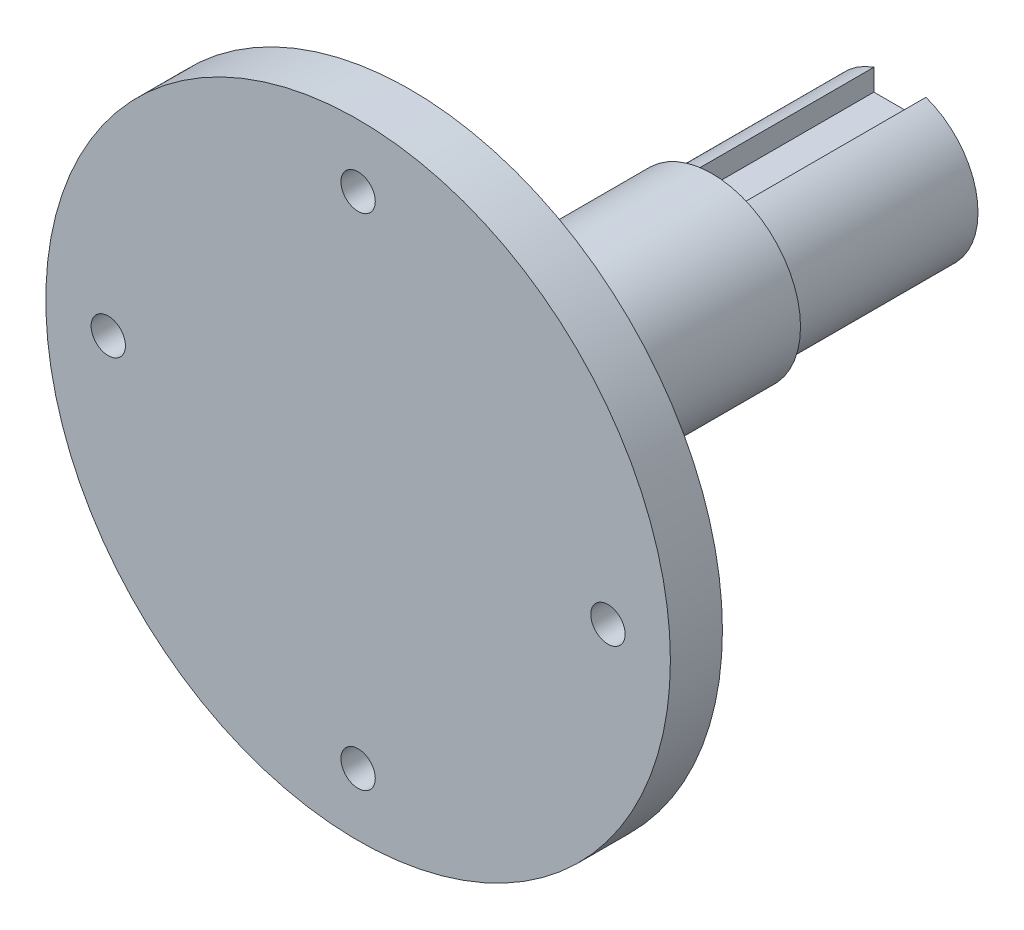
ISO-10303-21;
HEADER;
FILE_DESCRIPTION(('STEP AP214'),'2;1');
FILE_NAME('part.step','',(''),(''),'','','');
FILE_SCHEMA(('AUTOMOTIVE_DESIGN { 1 0 10303 214 1 1 1 1 }'));
ENDSEC;
DATA;
#1=APPLICATION_CONTEXT('core data for automotive mechanical design processes');
#2=APPLICATION_PROTOCOL_DEFINITION('international standard','automotive_design',2000,#1);
#3=PRODUCT_CONTEXT('',#1,'mechanical');
#4=PRODUCT('Part','Part','',(#3));
#5=PRODUCT_RELATED_PRODUCT_CATEGORY('part','',(#4));
#6=PRODUCT_DEFINITION_FORMATION('','',#4);
#7=PRODUCT_DEFINITION_CONTEXT('part definition',#1,'design');
#8=PRODUCT_DEFINITION('design','',#6,#7);
#9=PRODUCT_DEFINITION_SHAPE('','',#8);
#10=(LENGTH_UNIT() NAMED_UNIT(*) SI_UNIT(.MILLI.,.METRE.));
#11=(NAMED_UNIT(*) PLANE_ANGLE_UNIT() SI_UNIT($,.RADIAN.));
#12=(NAMED_UNIT(*) SI_UNIT($,.STERADIAN.) SOLID_ANGLE_UNIT());
#13=UNCERTAINTY_MEASURE_WITH_UNIT(LENGTH_MEASURE(1.E-05),#10,'distance_accuracy_value','');
#14=(GEOMETRIC_REPRESENTATION_CONTEXT(3) GLOBAL_UNCERTAINTY_ASSIGNED_CONTEXT((#13)) GLOBAL_UNIT_ASSIGNED_CONTEXT((#10,
#11,#12)) REPRESENTATION_CONTEXT('',''));
#15=CARTESIAN_POINT('',(0.,0.,0.));
#16=DIRECTION('',(0.,0.,1.));
#17=DIRECTION('',(1.,0.,0.));
#18=AXIS2_PLACEMENT_3D('',#15,#16,#17);
#19=CARTESIAN_POINT('',(0.,0.,20.05));
#20=DIRECTION('',(0.,0.,-1.));
#21=DIRECTION('',(-1.,0.,0.));
#22=AXIS2_PLACEMENT_3D('',#19,#20,#21);
#23=CYLINDRICAL_SURFACE('',#22,7.5);
#24=CARTESIAN_POINT('',(0.,0.,2.));
#25=DIRECTION('',(0.,0.,-1.));
#26=DIRECTION('',(-1.,0.,0.));
#27=AXIS2_PLACEMENT_3D('',#24,#25,#26);
#28=CIRCLE('',#27,7.5);
#29=CARTESIAN_POINT('',(2.5,7.07106781186548,2.));
#30=VERTEX_POINT('',#29);
#31=CARTESIAN_POINT('',(-2.5,7.07106781186548,2.));
#32=VERTEX_POINT('',#31);
#33=EDGE_CURVE('E90',#30,#32,#28,.T.);
#34=ORIENTED_EDGE('',*,*,#33,.F.);
#35=DIRECTION('',(0.,0.,-1.));
#36=VECTOR('',#35,1.);
#37=CARTESIAN_POINT('',(2.5,7.07106781186547,20.05));
#38=LINE('',#37,#36);
#39=CARTESIAN_POINT('',(2.5,7.07106781186548,20.05));
#40=VERTEX_POINT('',#39);
#41=EDGE_CURVE('E170',#30,#40,#38,.F.);
#42=ORIENTED_EDGE('',*,*,#41,.T.);
#43=CARTESIAN_POINT('',(0.,0.,20.05));
#44=DIRECTION('',(0.,0.,1.));
#45=DIRECTION('',(1.,0.,0.));
#46=AXIS2_PLACEMENT_3D('',#43,#44,#45);
#47=CIRCLE('',#46,7.5);
#48=CARTESIAN_POINT('',(-2.5,7.07106781186548,20.05));
#49=VERTEX_POINT('',#48);
#50=EDGE_CURVE('E111',#49,#40,#47,.T.);
#51=ORIENTED_EDGE('',*,*,#50,.F.);
#52=DIRECTION('',(0.,0.,-1.));
#53=VECTOR('',#52,1.);
#54=CARTESIAN_POINT('',(-2.5,7.07106781186548,20.05));
#55=LINE('',#54,#53);
#56=EDGE_CURVE('E104',#49,#32,#55,.T.);
#57=ORIENTED_EDGE('',*,*,#56,.T.);
#58=EDGE_LOOP('',(#34,#42,#51,#57));
#59=FACE_BOUND('',#58,.T.);
#60=ADVANCED_FACE('F45',(#59),#23,.T.);
#61=CARTESIAN_POINT('',(-2.5,5.,21.));
#62=DIRECTION('',(-1.,0.,0.));
#63=DIRECTION('',(0.,0.,1.));
#64=AXIS2_PLACEMENT_3D('',#61,#62,#63);
#65=PLANE('',#64);
#66=DIRECTION('',(0.,-1.,0.));
#67=VECTOR('',#66,1.);
#68=CARTESIAN_POINT('',(-2.5,5.,2.));
#69=LINE('',#68,#67);
#70=CARTESIAN_POINT('',(-2.5,5.,2.00000000000001));
#71=VERTEX_POINT('',#70);
#72=EDGE_CURVE('E62',#32,#71,#69,.T.);
#73=ORIENTED_EDGE('',*,*,#72,.F.);
#74=ORIENTED_EDGE('',*,*,#56,.F.);
#75=DIRECTION('',(0.,-1.,0.));
#76=VECTOR('',#75,1.);
#77=CARTESIAN_POINT('',(-2.5,0.,20.05));
#78=LINE('',#77,#76);
#79=CARTESIAN_POINT('',(-2.5,5.,20.05));
#80=VERTEX_POINT('',#79);
#81=EDGE_CURVE('E113',#49,#80,#78,.T.);
#82=ORIENTED_EDGE('',*,*,#81,.T.);
#83=DIRECTION('',(0.,0.,-1.));
#84=VECTOR('',#83,1.);
#85=CARTESIAN_POINT('',(-2.5,5.,21.));
#86=LINE('',#85,#84);
#87=EDGE_CURVE('E107',#80,#71,#86,.T.);
#88=ORIENTED_EDGE('',*,*,#87,.T.);
#89=EDGE_LOOP('',(#73,#74,#82,#88));
#90=FACE_BOUND('',#89,.T.);
#91=ADVANCED_FACE('F102',(#90),#65,.F.);
#92=CARTESIAN_POINT('',(2.5,5.,21.));
#93=DIRECTION('',(1.,0.,0.));
#94=DIRECTION('',(0.,0.,-1.));
#95=AXIS2_PLACEMENT_3D('',#92,#93,#94);
#96=PLANE('',#95);
#97=DIRECTION('',(0.,1.,0.));
#98=VECTOR('',#97,1.);
#99=CARTESIAN_POINT('',(2.5,5.,2.));
#100=LINE('',#99,#98);
#101=CARTESIAN_POINT('',(2.5,5.,2.));
#102=VERTEX_POINT('',#101);
#103=EDGE_CURVE('E93',#102,#30,#100,.T.);
#104=ORIENTED_EDGE('',*,*,#103,.F.);
#105=DIRECTION('',(0.,0.,-1.));
#106=VECTOR('',#105,1.);
#107=CARTESIAN_POINT('',(2.5,5.,21.));
#108=LINE('',#107,#106);
#109=CARTESIAN_POINT('',(2.5,5.,20.05));
#110=VERTEX_POINT('',#109);
#111=EDGE_CURVE('E156',#110,#102,#108,.T.);
#112=ORIENTED_EDGE('',*,*,#111,.F.);
#113=DIRECTION('',(0.,1.,0.));
#114=VECTOR('',#113,1.);
#115=CARTESIAN_POINT('',(2.5,0.,20.05));
#116=LINE('',#115,#114);
#117=EDGE_CURVE('E70',#110,#40,#116,.T.);
#118=ORIENTED_EDGE('',*,*,#117,.T.);
#119=ORIENTED_EDGE('',*,*,#41,.F.);
#120=EDGE_LOOP('',(#104,#112,#118,#119));
#121=FACE_BOUND('',#120,.T.);
#122=ADVANCED_FACE('F177',(#121),#96,.F.);
#123=CARTESIAN_POINT('',(2.5,5.,21.));
#124=DIRECTION('',(0.,-1.,0.));
#125=DIRECTION('',(0.,0.,-1.));
#126=AXIS2_PLACEMENT_3D('',#123,#124,#125);
#127=PLANE('',#126);
#128=DIRECTION('',(1.,0.,0.));
#129=VECTOR('',#128,1.);
#130=CARTESIAN_POINT('',(2.5,5.,2.));
#131=LINE('',#130,#129);
#132=EDGE_CURVE('E179',#71,#102,#131,.T.);
#133=ORIENTED_EDGE('',*,*,#132,.F.);
#134=ORIENTED_EDGE('',*,*,#87,.F.);
#135=DIRECTION('',(1.,0.,0.));
#136=VECTOR('',#135,1.);
#137=CARTESIAN_POINT('',(0.,5.,20.05));
#138=LINE('',#137,#136);
#139=EDGE_CURVE('E119',#80,#110,#138,.T.);
#140=ORIENTED_EDGE('',*,*,#139,.T.);
#141=ORIENTED_EDGE('',*,*,#111,.T.);
#142=EDGE_LOOP('',(#133,#134,#140,#141));
#143=FACE_BOUND('',#142,.T.);
#144=ADVANCED_FACE('F175',(#143),#127,.F.);
#145=CARTESIAN_POINT('',(0.,0.,44.05));
#146=DIRECTION('',(0.,0.,-1.));
#147=DIRECTION('',(-1.,0.,0.));
#148=AXIS2_PLACEMENT_3D('',#145,#146,#147);
#149=CYLINDRICAL_SURFACE('',#148,8.5);
#150=CARTESIAN_POINT('',(0.,0.,43.45));
#151=DIRECTION('',(0.,0.,1.));
#152=DIRECTION('',(1.,0.,0.));
#153=AXIS2_PLACEMENT_3D('',#150,#151,#152);
#154=CIRCLE('',#153,8.5);
#155=CARTESIAN_POINT('',(8.5,0.,43.45));
#156=VERTEX_POINT('',#155);
#157=EDGE_CURVE('E55',#156,#156,#154,.F.);
#158=ORIENTED_EDGE('',*,*,#157,.T.);
#159=EDGE_LOOP('',(#158));
#160=FACE_BOUND('',#159,.T.);
#161=CARTESIAN_POINT('',(0.,0.,20.05));
#162=DIRECTION('',(0.,0.,1.));
#163=DIRECTION('',(1.,0.,0.));
#164=AXIS2_PLACEMENT_3D('',#161,#162,#163);
#165=CIRCLE('',#164,8.5);
#166=CARTESIAN_POINT('',(8.5,0.,20.05));
#167=VERTEX_POINT('',#166);
#168=EDGE_CURVE('E150',#167,#167,#165,.T.);
#169=ORIENTED_EDGE('',*,*,#168,.T.);
#170=EDGE_LOOP('',(#169));
#171=FACE_BOUND('',#170,.T.);
#172=ADVANCED_FACE('F130',(#160,#171),#149,.T.);
#173=CARTESIAN_POINT('',(0.,0.,20.05));
#174=DIRECTION('',(0.,0.,1.));
#175=DIRECTION('',(1.,0.,0.));
#176=AXIS2_PLACEMENT_3D('',#173,#174,#175);
#177=PLANE('',#176);
#178=ORIENTED_EDGE('',*,*,#81,.F.);
#179=ORIENTED_EDGE('',*,*,#50,.T.);
#180=ORIENTED_EDGE('',*,*,#117,.F.);
#181=ORIENTED_EDGE('',*,*,#139,.F.);
#182=EDGE_LOOP('',(#178,#179,#180,#181));
#183=FACE_BOUND('',#182,.T.);
#184=ORIENTED_EDGE('',*,*,#168,.F.);
#185=EDGE_LOOP('',(#184));
#186=FACE_BOUND('',#185,.T.);
#187=ADVANCED_FACE('F143',(#183,#186),#177,.F.);
#188=CARTESIAN_POINT('',(0.,0.,44.05));
#189=DIRECTION('',(0.,0.,1.));
#190=DIRECTION('',(1.,0.,0.));
#191=AXIS2_PLACEMENT_3D('',#188,#189,#190);
#192=PLANE('',#191);
#193=CARTESIAN_POINT('',(0.,0.,44.05));
#194=DIRECTION('',(0.,0.,1.));
#195=DIRECTION('',(1.,0.,0.));
#196=AXIS2_PLACEMENT_3D('',#193,#194,#195);
#197=CIRCLE('',#196,9.1);
#198=CARTESIAN_POINT('',(9.1,0.,44.05));
#199=VERTEX_POINT('',#198);
#200=EDGE_CURVE('E117',#199,#199,#197,.T.);
#201=ORIENTED_EDGE('',*,*,#200,.T.);
#202=EDGE_LOOP('',(#201));
#203=FACE_BOUND('',#202,.T.);
#204=CARTESIAN_POINT('',(0.,0.,44.05));
#205=DIRECTION('',(0.,0.,1.));
#206=DIRECTION('',(1.,0.,0.));
#207=AXIS2_PLACEMENT_3D('',#204,#205,#206);
#208=CIRCLE('',#207,11.25);
#209=CARTESIAN_POINT('',(11.25,0.,44.05));
#210=VERTEX_POINT('',#209);
#211=EDGE_CURVE('E147',#210,#210,#208,.T.);
#212=ORIENTED_EDGE('',*,*,#211,.F.);
#213=EDGE_LOOP('',(#212));
#214=FACE_BOUND('',#213,.T.);
#215=ADVANCED_FACE('F139',(#203,#214),#192,.F.);
#216=CARTESIAN_POINT('',(0.,0.,54.05));
#217=DIRECTION('',(0.,0.,-1.));
#218=DIRECTION('',(-1.,0.,0.));
#219=AXIS2_PLACEMENT_3D('',#216,#217,#218);
#220=CYLINDRICAL_SURFACE('',#219,30.);
#221=CARTESIAN_POINT('',(0.,0.,54.05));
#222=DIRECTION('',(0.,0.,1.));
#223=DIRECTION('',(1.,0.,0.));
#224=AXIS2_PLACEMENT_3D('',#221,#222,#223);
#225=CIRCLE('',#224,30.);
#226=CARTESIAN_POINT('',(30.,0.,54.05));
#227=VERTEX_POINT('',#226);
#228=EDGE_CURVE('E151',#227,#227,#225,.T.);
#229=ORIENTED_EDGE('',*,*,#228,.F.);
#230=EDGE_LOOP('',(#229));
#231=FACE_BOUND('',#230,.T.);
#232=CARTESIAN_POINT('',(0.,0.,49.05));
#233=DIRECTION('',(0.,0.,1.));
#234=DIRECTION('',(1.,0.,0.));
#235=AXIS2_PLACEMENT_3D('',#232,#233,#234);
#236=CIRCLE('',#235,30.);
#237=CARTESIAN_POINT('',(30.,0.,49.05));
#238=VERTEX_POINT('',#237);
#239=EDGE_CURVE('E159',#238,#238,#236,.T.);
#240=ORIENTED_EDGE('',*,*,#239,.T.);
#241=EDGE_LOOP('',(#240));
#242=FACE_BOUND('',#241,.T.);
#243=ADVANCED_FACE('F142',(#231,#242),#220,.T.);
#244=CARTESIAN_POINT('',(0.,0.,54.05));
#245=DIRECTION('',(0.,0.,1.));
#246=DIRECTION('',(1.,0.,0.));
#247=AXIS2_PLACEMENT_3D('',#244,#245,#246);
#248=PLANE('',#247);
#249=CARTESIAN_POINT('',(0.,24.,54.05));
#250=DIRECTION('',(0.,0.,1.));
#251=DIRECTION('',(1.,0.,0.));
#252=AXIS2_PLACEMENT_3D('',#249,#250,#251);
#253=CIRCLE('',#252,1.64999999999999);
#254=CARTESIAN_POINT('',(1.64999999999999,24.,54.05));
#255=VERTEX_POINT('',#254);
#256=EDGE_CURVE('E187',#255,#255,#253,.T.);
#257=ORIENTED_EDGE('',*,*,#256,.F.);
#258=EDGE_LOOP('',(#257));
#259=FACE_BOUND('',#258,.T.);
#260=CARTESIAN_POINT('',(0.,-24.,54.05));
#261=DIRECTION('',(0.,0.,1.));
#262=DIRECTION('',(1.,0.,0.));
#263=AXIS2_PLACEMENT_3D('',#260,#261,#262);
#264=CIRCLE('',#263,1.64999999999999);
#265=CARTESIAN_POINT('',(1.64999999999999,-24.,54.05));
#266=VERTEX_POINT('',#265);
#267=EDGE_CURVE('E195',#266,#266,#264,.T.);
#268=ORIENTED_EDGE('',*,*,#267,.F.);
#269=EDGE_LOOP('',(#268));
#270=FACE_BOUND('',#269,.T.);
#271=CARTESIAN_POINT('',(24.,0.,54.05));
#272=DIRECTION('',(0.,0.,1.));
#273=DIRECTION('',(1.,0.,0.));
#274=AXIS2_PLACEMENT_3D('',#271,#272,#273);
#275=CIRCLE('',#274,1.64999999999999);
#276=CARTESIAN_POINT('',(25.65,0.,54.05));
#277=VERTEX_POINT('',#276);
#278=EDGE_CURVE('E203',#277,#277,#275,.T.);
#279=ORIENTED_EDGE('',*,*,#278,.F.);
#280=EDGE_LOOP('',(#279));
#281=FACE_BOUND('',#280,.T.);
#282=CARTESIAN_POINT('',(-24.,0.,54.05));
#283=DIRECTION('',(0.,0.,1.));
#284=DIRECTION('',(1.,0.,0.));
#285=AXIS2_PLACEMENT_3D('',#282,#283,#284);
#286=CIRCLE('',#285,1.64999999999999);
#287=CARTESIAN_POINT('',(-22.35,0.,54.05));
#288=VERTEX_POINT('',#287);
#289=EDGE_CURVE('E211',#288,#288,#286,.T.);
#290=ORIENTED_EDGE('',*,*,#289,.F.);
#291=EDGE_LOOP('',(#290));
#292=FACE_BOUND('',#291,.T.);
#293=ORIENTED_EDGE('',*,*,#228,.T.);
#294=EDGE_LOOP('',(#293));
#295=FACE_BOUND('',#294,.T.);
#296=ADVANCED_FACE('F226',(#259,#270,#281,#292,#295),#248,.T.);
#297=CARTESIAN_POINT('',(0.,0.,49.05));
#298=DIRECTION('',(0.,0.,1.));
#299=DIRECTION('',(1.,0.,0.));
#300=AXIS2_PLACEMENT_3D('',#297,#298,#299);
#301=PLANE('',#300);
#302=CARTESIAN_POINT('',(0.,24.,49.05));
#303=DIRECTION('',(0.,0.,1.));
#304=DIRECTION('',(1.,0.,0.));
#305=AXIS2_PLACEMENT_3D('',#302,#303,#304);
#306=CIRCLE('',#305,1.64999999999999);
#307=CARTESIAN_POINT('',(1.64999999999999,24.,49.05));
#308=VERTEX_POINT('',#307);
#309=EDGE_CURVE('E191',#308,#308,#306,.T.);
#310=ORIENTED_EDGE('',*,*,#309,.T.);
#311=EDGE_LOOP('',(#310));
#312=FACE_BOUND('',#311,.T.);
#313=CARTESIAN_POINT('',(0.,-24.,49.05));
#314=DIRECTION('',(0.,0.,1.));
#315=DIRECTION('',(1.,0.,0.));
#316=AXIS2_PLACEMENT_3D('',#313,#314,#315);
#317=CIRCLE('',#316,1.64999999999999);
#318=CARTESIAN_POINT('',(1.64999999999999,-24.,49.05));
#319=VERTEX_POINT('',#318);
#320=EDGE_CURVE('E199',#319,#319,#317,.T.);
#321=ORIENTED_EDGE('',*,*,#320,.T.);
#322=EDGE_LOOP('',(#321));
#323=FACE_BOUND('',#322,.T.);
#324=CARTESIAN_POINT('',(24.,0.,49.05));
#325=DIRECTION('',(0.,0.,1.));
#326=DIRECTION('',(1.,0.,0.));
#327=AXIS2_PLACEMENT_3D('',#324,#325,#326);
#328=CIRCLE('',#327,1.64999999999999);
#329=CARTESIAN_POINT('',(25.65,0.,49.05));
#330=VERTEX_POINT('',#329);
#331=EDGE_CURVE('E207',#330,#330,#328,.T.);
#332=ORIENTED_EDGE('',*,*,#331,.T.);
#333=EDGE_LOOP('',(#332));
#334=FACE_BOUND('',#333,.T.);
#335=CARTESIAN_POINT('',(-24.,0.,49.05));
#336=DIRECTION('',(0.,0.,1.));
#337=DIRECTION('',(1.,0.,0.));
#338=AXIS2_PLACEMENT_3D('',#335,#336,#337);
#339=CIRCLE('',#338,1.64999999999999);
#340=CARTESIAN_POINT('',(-22.35,0.,49.05));
#341=VERTEX_POINT('',#340);
#342=EDGE_CURVE('E215',#341,#341,#339,.T.);
#343=ORIENTED_EDGE('',*,*,#342,.T.);
#344=EDGE_LOOP('',(#343));
#345=FACE_BOUND('',#344,.T.);
#346=CARTESIAN_POINT('',(0.,0.,49.05));
#347=DIRECTION('',(0.,0.,1.));
#348=DIRECTION('',(1.,0.,0.));
#349=AXIS2_PLACEMENT_3D('',#346,#347,#348);
#350=CIRCLE('',#349,16.25);
#351=CARTESIAN_POINT('',(16.25,0.,49.05));
#352=VERTEX_POINT('',#351);
#353=EDGE_CURVE('E11',#352,#352,#350,.T.);
#354=ORIENTED_EDGE('',*,*,#353,.T.);
#355=EDGE_LOOP('',(#354));
#356=FACE_BOUND('',#355,.T.);
#357=ORIENTED_EDGE('',*,*,#239,.F.);
#358=EDGE_LOOP('',(#357));
#359=FACE_BOUND('',#358,.T.);
#360=ADVANCED_FACE('F136',(#312,#323,#334,#345,#356,#359),#301,.F.);
#361=CARTESIAN_POINT('',(0.,0.,43.45));
#362=DIRECTION('',(0.,0.,1.));
#363=DIRECTION('',(1.,0.,0.));
#364=AXIS2_PLACEMENT_3D('',#361,#362,#363);
#365=TOROIDAL_SURFACE('',#364,9.1,0.6);
#366=ORIENTED_EDGE('',*,*,#157,.F.);
#367=EDGE_LOOP('',(#366));
#368=FACE_BOUND('',#367,.T.);
#369=ORIENTED_EDGE('',*,*,#200,.F.);
#370=EDGE_LOOP('',(#369));
#371=FACE_BOUND('',#370,.T.);
#372=ADVANCED_FACE('F133',(#368,#371),#365,.F.);
#373=CARTESIAN_POINT('',(0.,0.,44.05));
#374=DIRECTION('',(0.,0.,1.));
#375=DIRECTION('',(1.,0.,0.));
#376=AXIS2_PLACEMENT_3D('',#373,#374,#375);
#377=TOROIDAL_SURFACE('',#376,16.25,5.);
#378=ORIENTED_EDGE('',*,*,#211,.T.);
#379=EDGE_LOOP('',(#378));
#380=FACE_BOUND('',#379,.T.);
#381=ORIENTED_EDGE('',*,*,#353,.F.);
#382=EDGE_LOOP('',(#381));
#383=FACE_BOUND('',#382,.T.);
#384=ADVANCED_FACE('F47',(#380,#383),#377,.F.);
#385=CARTESIAN_POINT('',(-24.,0.,54.05));
#386=DIRECTION('',(0.,0.,1.));
#387=DIRECTION('',(1.,0.,0.));
#388=AXIS2_PLACEMENT_3D('',#385,#386,#387);
#389=CYLINDRICAL_SURFACE('',#388,1.64999999999999);
#390=ORIENTED_EDGE('',*,*,#289,.T.);
#391=EDGE_LOOP('',(#390));
#392=FACE_BOUND('',#391,.T.);
#393=ORIENTED_EDGE('',*,*,#342,.F.);
#394=EDGE_LOOP('',(#393));
#395=FACE_BOUND('',#394,.T.);
#396=ADVANCED_FACE('F275',(#392,#395),#389,.F.);
#397=CARTESIAN_POINT('',(24.,0.,54.05));
#398=DIRECTION('',(0.,0.,1.));
#399=DIRECTION('',(1.,0.,0.));
#400=AXIS2_PLACEMENT_3D('',#397,#398,#399);
#401=CYLINDRICAL_SURFACE('',#400,1.64999999999999);
#402=ORIENTED_EDGE('',*,*,#278,.T.);
#403=EDGE_LOOP('',(#402));
#404=FACE_BOUND('',#403,.T.);
#405=ORIENTED_EDGE('',*,*,#331,.F.);
#406=EDGE_LOOP('',(#405));
#407=FACE_BOUND('',#406,.T.);
#408=ADVANCED_FACE('F280',(#404,#407),#401,.F.);
#409=CARTESIAN_POINT('',(0.,-24.,54.05));
#410=DIRECTION('',(0.,0.,1.));
#411=DIRECTION('',(1.,0.,0.));
#412=AXIS2_PLACEMENT_3D('',#409,#410,#411);
#413=CYLINDRICAL_SURFACE('',#412,1.64999999999999);
#414=ORIENTED_EDGE('',*,*,#267,.T.);
#415=EDGE_LOOP('',(#414));
#416=FACE_BOUND('',#415,.T.);
#417=ORIENTED_EDGE('',*,*,#320,.F.);
#418=EDGE_LOOP('',(#417));
#419=FACE_BOUND('',#418,.T.);
#420=ADVANCED_FACE('F292',(#416,#419),#413,.F.);
#421=CARTESIAN_POINT('',(0.,24.,54.05));
#422=DIRECTION('',(0.,0.,1.));
#423=DIRECTION('',(1.,0.,0.));
#424=AXIS2_PLACEMENT_3D('',#421,#422,#423);
#425=CYLINDRICAL_SURFACE('',#424,1.64999999999999);
#426=ORIENTED_EDGE('',*,*,#256,.T.);
#427=EDGE_LOOP('',(#426));
#428=FACE_BOUND('',#427,.T.);
#429=ORIENTED_EDGE('',*,*,#309,.F.);
#430=EDGE_LOOP('',(#429));
#431=FACE_BOUND('',#430,.T.);
#432=ADVANCED_FACE('F271',(#428,#431),#425,.F.);
#433=CARTESIAN_POINT('',(0.,0.,2.));
#434=DIRECTION('',(0.,0.,-1.));
#435=DIRECTION('',(-1.,0.,0.));
#436=AXIS2_PLACEMENT_3D('',#433,#434,#435);
#437=PLANE('',#436);
#438=CARTESIAN_POINT('',(0.,0.,2.));
#439=DIRECTION('',(0.,0.,-1.));
#440=DIRECTION('',(-1.,0.,0.));
#441=AXIS2_PLACEMENT_3D('',#438,#439,#440);
#442=CIRCLE('',#441,2.5);
#443=CARTESIAN_POINT('',(-2.5,0.,2.));
#444=VERTEX_POINT('',#443);
#445=EDGE_CURVE('E49',#444,#444,#442,.F.);
#446=ORIENTED_EDGE('',*,*,#445,.T.);
#447=EDGE_LOOP('',(#446));
#448=FACE_BOUND('',#447,.T.);
#449=ORIENTED_EDGE('',*,*,#72,.T.);
#450=ORIENTED_EDGE('',*,*,#132,.T.);
#451=ORIENTED_EDGE('',*,*,#103,.T.);
#452=ORIENTED_EDGE('',*,*,#33,.T.);
#453=EDGE_LOOP('',(#449,#450,#451,#452));
#454=FACE_BOUND('',#453,.T.);
#455=ADVANCED_FACE('F91',(#448,#454),#437,.T.);
#456=CARTESIAN_POINT('',(0.,0.,23.4978484524311));
#457=DIRECTION('',(0.,0.,-1.));
#458=DIRECTION('',(-1.,0.,0.));
#459=AXIS2_PLACEMENT_3D('',#456,#457,#458);
#460=CONICAL_SURFACE('',#459,2.49999999999999,1.02974425867665);
#461=CARTESIAN_POINT('',(0.,0.,25.));
#462=VERTEX_POINT('',#461);
#463=VERTEX_LOOP('',#462);
#464=FACE_BOUND('',#463,.T.);
#465=CARTESIAN_POINT('',(0.,0.,23.4978484524311));
#466=DIRECTION('',(0.,0.,-1.));
#467=DIRECTION('',(-1.,0.,0.));
#468=AXIS2_PLACEMENT_3D('',#465,#466,#467);
#469=CIRCLE('',#468,2.49999999999999);
#470=CARTESIAN_POINT('',(-2.49999999999999,0.,23.4978484524311));
#471=VERTEX_POINT('',#470);
#472=EDGE_CURVE('E109',#471,#471,#469,.T.);
#473=ORIENTED_EDGE('',*,*,#472,.T.);
#474=EDGE_LOOP('',(#473));
#475=FACE_BOUND('',#474,.T.);
#476=ADVANCED_FACE('F315',(#464,#475),#460,.F.);
#477=CARTESIAN_POINT('',(0.,0.,0.));
#478=DIRECTION('',(0.,0.,-1.));
#479=DIRECTION('',(-1.,0.,0.));
#480=AXIS2_PLACEMENT_3D('',#477,#478,#479);
#481=CYLINDRICAL_SURFACE('',#480,2.5);
#482=ORIENTED_EDGE('',*,*,#472,.F.);
#483=EDGE_LOOP('',(#482));
#484=FACE_BOUND('',#483,.T.);
#485=ORIENTED_EDGE('',*,*,#445,.F.);
#486=EDGE_LOOP('',(#485));
#487=FACE_BOUND('',#486,.T.);
#488=ADVANCED_FACE('F324',(#484,#487),#481,.F.);
#489=CLOSED_SHELL('',(#60,#91,#122,#144,#172,#187,#215,#243,#296,#360,#372,#384,#396,#408,#420,
#432,#455,#476,#488));
#490=MANIFOLD_SOLID_BREP('B2',#489);
#491=ADVANCED_BREP_SHAPE_REPRESENTATION('',(#18,#490),#14);
#492=SHAPE_DEFINITION_REPRESENTATION(#9,#491);
ENDSEC;
END-ISO-10303-21;
